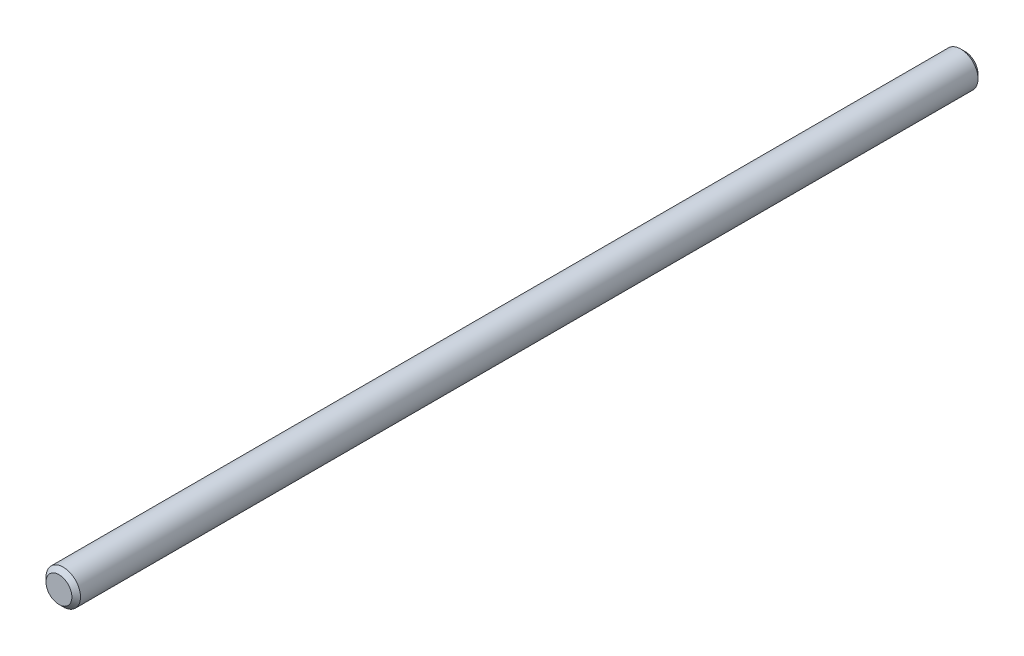
ISO-10303-21;
HEADER;
FILE_DESCRIPTION(('STEP AP214'),'2;1');
FILE_NAME('part.step','',(''),(''),'','','');
FILE_SCHEMA(('AUTOMOTIVE_DESIGN { 1 0 10303 214 1 1 1 1 }'));
ENDSEC;
DATA;
#1=APPLICATION_CONTEXT('core data for automotive mechanical design processes');
#2=APPLICATION_PROTOCOL_DEFINITION('international standard','automotive_design',2000,#1);
#3=PRODUCT_CONTEXT('',#1,'mechanical');
#4=PRODUCT('Part','Part','',(#3));
#5=PRODUCT_RELATED_PRODUCT_CATEGORY('part','',(#4));
#6=PRODUCT_DEFINITION_FORMATION('','',#4);
#7=PRODUCT_DEFINITION_CONTEXT('part definition',#1,'design');
#8=PRODUCT_DEFINITION('design','',#6,#7);
#9=PRODUCT_DEFINITION_SHAPE('','',#8);
#10=(LENGTH_UNIT() NAMED_UNIT(*) SI_UNIT(.MILLI.,.METRE.));
#11=(NAMED_UNIT(*) PLANE_ANGLE_UNIT() SI_UNIT($,.RADIAN.));
#12=(NAMED_UNIT(*) SI_UNIT($,.STERADIAN.) SOLID_ANGLE_UNIT());
#13=UNCERTAINTY_MEASURE_WITH_UNIT(LENGTH_MEASURE(1.E-05),#10,'distance_accuracy_value','');
#14=(GEOMETRIC_REPRESENTATION_CONTEXT(3) GLOBAL_UNCERTAINTY_ASSIGNED_CONTEXT((#13)) GLOBAL_UNIT_ASSIGNED_CONTEXT((#10,
#11,#12)) REPRESENTATION_CONTEXT('',''));
#15=CARTESIAN_POINT('',(0.,0.,0.));
#16=DIRECTION('',(0.,0.,1.));
#17=DIRECTION('',(1.,0.,0.));
#18=AXIS2_PLACEMENT_3D('',#15,#16,#17);
#19=CARTESIAN_POINT('',(0.,0.,52.5));
#20=DIRECTION('',(0.,0.,-1.));
#21=DIRECTION('',(-1.,0.,0.));
#22=AXIS2_PLACEMENT_3D('',#19,#20,#21);
#23=CYLINDRICAL_SURFACE('',#22,2.);
#24=CARTESIAN_POINT('',(0.,0.,-52.));
#25=DIRECTION('',(0.,0.,1.));
#26=DIRECTION('',(1.,0.,0.));
#27=AXIS2_PLACEMENT_3D('',#24,#25,#26);
#28=CIRCLE('',#27,2.);
#29=CARTESIAN_POINT('',(2.,0.,-52.));
#30=VERTEX_POINT('',#29);
#31=EDGE_CURVE('E61',#30,#30,#28,.T.);
#32=ORIENTED_EDGE('',*,*,#31,.T.);
#33=EDGE_LOOP('',(#32));
#34=FACE_BOUND('',#33,.T.);
#35=CARTESIAN_POINT('',(0.,0.,52.));
#36=DIRECTION('',(0.,0.,1.));
#37=DIRECTION('',(1.,0.,0.));
#38=AXIS2_PLACEMENT_3D('',#35,#36,#37);
#39=CIRCLE('',#38,2.);
#40=CARTESIAN_POINT('',(2.,0.,52.));
#41=VERTEX_POINT('',#40);
#42=EDGE_CURVE('E65',#41,#41,#39,.F.);
#43=ORIENTED_EDGE('',*,*,#42,.T.);
#44=EDGE_LOOP('',(#43));
#45=FACE_BOUND('',#44,.T.);
#46=ADVANCED_FACE('F49',(#34,#45),#23,.T.);
#47=CARTESIAN_POINT('',(0.,0.,52.5));
#48=DIRECTION('',(0.,0.,1.));
#49=DIRECTION('',(1.,0.,0.));
#50=AXIS2_PLACEMENT_3D('',#47,#48,#49);
#51=PLANE('',#50);
#52=CARTESIAN_POINT('',(0.,0.,52.5));
#53=DIRECTION('',(0.,0.,1.));
#54=DIRECTION('',(1.,0.,0.));
#55=AXIS2_PLACEMENT_3D('',#52,#53,#54);
#56=CIRCLE('',#55,1.5);
#57=CARTESIAN_POINT('',(1.5,0.,52.5));
#58=VERTEX_POINT('',#57);
#59=EDGE_CURVE('E10',#58,#58,#56,.T.);
#60=ORIENTED_EDGE('',*,*,#59,.T.);
#61=EDGE_LOOP('',(#60));
#62=FACE_BOUND('',#61,.T.);
#63=ADVANCED_FACE('F81',(#62),#51,.T.);
#64=CARTESIAN_POINT('',(0.,0.,-52.5));
#65=DIRECTION('',(0.,0.,1.));
#66=DIRECTION('',(1.,0.,0.));
#67=AXIS2_PLACEMENT_3D('',#64,#65,#66);
#68=PLANE('',#67);
#69=CARTESIAN_POINT('',(0.,0.,-52.5));
#70=DIRECTION('',(0.,0.,1.));
#71=DIRECTION('',(1.,0.,0.));
#72=AXIS2_PLACEMENT_3D('',#69,#70,#71);
#73=CIRCLE('',#72,1.5);
#74=CARTESIAN_POINT('',(1.5,0.,-52.5));
#75=VERTEX_POINT('',#74);
#76=EDGE_CURVE('E57',#75,#75,#73,.F.);
#77=ORIENTED_EDGE('',*,*,#76,.T.);
#78=EDGE_LOOP('',(#77));
#79=FACE_BOUND('',#78,.T.);
#80=ADVANCED_FACE('F78',(#79),#68,.F.);
#81=CARTESIAN_POINT('',(0.,0.,-52.));
#82=DIRECTION('',(0.,0.,1.));
#83=DIRECTION('',(1.,0.,0.));
#84=AXIS2_PLACEMENT_3D('',#81,#82,#83);
#85=CONICAL_SURFACE('',#84,2.,0.785398163397433);
#86=ORIENTED_EDGE('',*,*,#76,.F.);
#87=EDGE_LOOP('',(#86));
#88=FACE_BOUND('',#87,.T.);
#89=ORIENTED_EDGE('',*,*,#31,.F.);
#90=EDGE_LOOP('',(#89));
#91=FACE_BOUND('',#90,.T.);
#92=ADVANCED_FACE('F74',(#88,#91),#85,.T.);
#93=CARTESIAN_POINT('',(0.,0.,52.5));
#94=DIRECTION('',(0.,0.,-1.));
#95=DIRECTION('',(-1.,0.,0.));
#96=AXIS2_PLACEMENT_3D('',#93,#94,#95);
#97=CONICAL_SURFACE('',#96,1.5,0.785398163397453);
#98=ORIENTED_EDGE('',*,*,#42,.F.);
#99=EDGE_LOOP('',(#98));
#100=FACE_BOUND('',#99,.T.);
#101=ORIENTED_EDGE('',*,*,#59,.F.);
#102=EDGE_LOOP('',(#101));
#103=FACE_BOUND('',#102,.T.);
#104=ADVANCED_FACE('F52',(#100,#103),#97,.T.);
#105=CLOSED_SHELL('',(#46,#63,#80,#92,#104));
#106=MANIFOLD_SOLID_BREP('B2',#105);
#107=ADVANCED_BREP_SHAPE_REPRESENTATION('',(#18,#106),#14);
#108=SHAPE_DEFINITION_REPRESENTATION(#9,#107);
ENDSEC;
END-ISO-10303-21;
